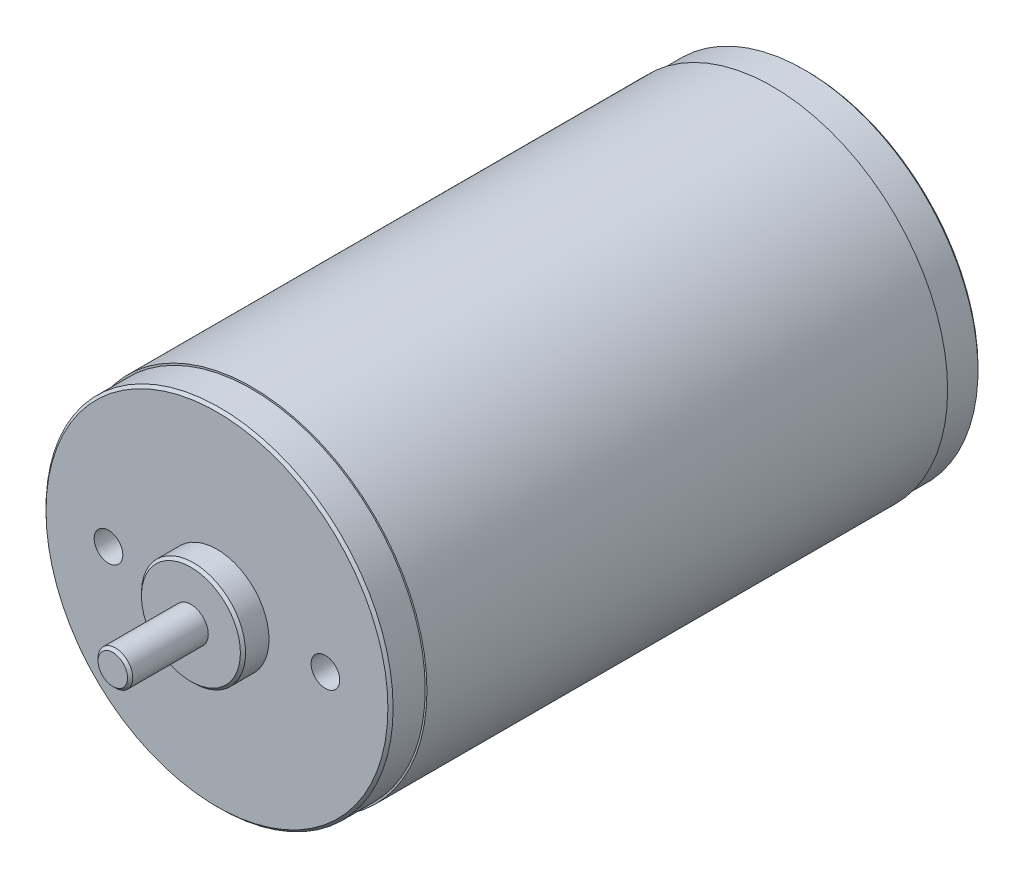
ISO-10303-21;
HEADER;
FILE_DESCRIPTION(('STEP AP214'),'2;1');
FILE_NAME('part.step','',(''),(''),'','','');
FILE_SCHEMA(('AUTOMOTIVE_DESIGN { 1 0 10303 214 1 1 1 1 }'));
ENDSEC;
DATA;
#1=APPLICATION_CONTEXT('core data for automotive mechanical design processes');
#2=APPLICATION_PROTOCOL_DEFINITION('international standard','automotive_design',2000,#1);
#3=PRODUCT_CONTEXT('',#1,'mechanical');
#4=PRODUCT('Part','Part','',(#3));
#5=PRODUCT_RELATED_PRODUCT_CATEGORY('part','',(#4));
#6=PRODUCT_DEFINITION_FORMATION('','',#4);
#7=PRODUCT_DEFINITION_CONTEXT('part definition',#1,'design');
#8=PRODUCT_DEFINITION('design','',#6,#7);
#9=PRODUCT_DEFINITION_SHAPE('','',#8);
#10=(LENGTH_UNIT() NAMED_UNIT(*) SI_UNIT(.MILLI.,.METRE.));
#11=(NAMED_UNIT(*) PLANE_ANGLE_UNIT() SI_UNIT($,.RADIAN.));
#12=(NAMED_UNIT(*) SI_UNIT($,.STERADIAN.) SOLID_ANGLE_UNIT());
#13=UNCERTAINTY_MEASURE_WITH_UNIT(LENGTH_MEASURE(1.E-05),#10,'distance_accuracy_value','');
#14=(GEOMETRIC_REPRESENTATION_CONTEXT(3) GLOBAL_UNCERTAINTY_ASSIGNED_CONTEXT((#13)) GLOBAL_UNIT_ASSIGNED_CONTEXT((#10,
#11,#12)) REPRESENTATION_CONTEXT('',''));
#15=CARTESIAN_POINT('',(0.,0.,0.));
#16=DIRECTION('',(0.,0.,1.));
#17=DIRECTION('',(1.,0.,0.));
#18=AXIS2_PLACEMENT_3D('',#15,#16,#17);
#19=CARTESIAN_POINT('',(0.,0.,-68.));
#20=DIRECTION('',(0.,0.,-1.));
#21=DIRECTION('',(-1.,0.,0.));
#22=AXIS2_PLACEMENT_3D('',#19,#20,#21);
#23=PLANE('',#22);
#24=CARTESIAN_POINT('',(0.,0.,-68.));
#25=DIRECTION('',(0.,0.,-1.));
#26=DIRECTION('',(-1.,0.,0.));
#27=AXIS2_PLACEMENT_3D('',#24,#25,#26);
#28=CIRCLE('',#27,19.7000000000306);
#29=CARTESIAN_POINT('',(-19.7000000000306,0.,-68.));
#30=VERTEX_POINT('',#29);
#31=EDGE_CURVE('E90',#30,#30,#28,.T.);
#32=ORIENTED_EDGE('',*,*,#31,.T.);
#33=EDGE_LOOP('',(#32));
#34=FACE_BOUND('',#33,.T.);
#35=CARTESIAN_POINT('',(0.,0.,-68.));
#36=DIRECTION('',(0.,0.,-1.));
#37=DIRECTION('',(-1.,0.,0.));
#38=AXIS2_PLACEMENT_3D('',#35,#36,#37);
#39=CIRCLE('',#38,6.325);
#40=CARTESIAN_POINT('',(-6.325,0.,-68.));
#41=VERTEX_POINT('',#40);
#42=EDGE_CURVE('E69',#41,#41,#39,.T.);
#43=ORIENTED_EDGE('',*,*,#42,.F.);
#44=EDGE_LOOP('',(#43));
#45=FACE_BOUND('',#44,.T.);
#46=ADVANCED_FACE('F34',(#34,#45),#23,.T.);
#47=CARTESIAN_POINT('',(20.2,0.,-64.));
#48=DIRECTION('',(0.,0.,-1.));
#49=DIRECTION('',(-1.,0.,0.));
#50=AXIS2_PLACEMENT_3D('',#47,#48,#49);
#51=PLANE('',#50);
#52=CARTESIAN_POINT('',(0.,0.,-64.));
#53=DIRECTION('',(0.,0.,1.));
#54=DIRECTION('',(1.,0.,0.));
#55=AXIS2_PLACEMENT_3D('',#52,#53,#54);
#56=CIRCLE('',#55,20.2);
#57=CARTESIAN_POINT('',(20.2,0.,-64.));
#58=VERTEX_POINT('',#57);
#59=EDGE_CURVE('E87',#58,#58,#56,.T.);
#60=ORIENTED_EDGE('',*,*,#59,.F.);
#61=EDGE_LOOP('',(#60));
#62=FACE_BOUND('',#61,.T.);
#63=CARTESIAN_POINT('',(0.,0.,-64.));
#64=DIRECTION('',(0.,0.,-1.));
#65=DIRECTION('',(-1.,0.,0.));
#66=AXIS2_PLACEMENT_3D('',#63,#64,#65);
#67=CIRCLE('',#66,20.);
#68=CARTESIAN_POINT('',(-20.,0.,-64.));
#69=VERTEX_POINT('',#68);
#70=EDGE_CURVE('E72',#69,#69,#67,.T.);
#71=ORIENTED_EDGE('',*,*,#70,.F.);
#72=EDGE_LOOP('',(#71));
#73=FACE_BOUND('',#72,.T.);
#74=ADVANCED_FACE('F129',(#62,#73),#51,.T.);
#75=CARTESIAN_POINT('',(0.,0.,3.));
#76=DIRECTION('',(0.,0.,1.));
#77=DIRECTION('',(1.,0.,0.));
#78=AXIS2_PLACEMENT_3D('',#75,#76,#77);
#79=PLANE('',#78);
#80=CARTESIAN_POINT('',(0.,0.,3.));
#81=DIRECTION('',(0.,0.,1.));
#82=DIRECTION('',(1.,0.,0.));
#83=AXIS2_PLACEMENT_3D('',#80,#81,#82);
#84=CIRCLE('',#83,5.70000000003062);
#85=CARTESIAN_POINT('',(5.70000000003062,0.,3.));
#86=VERTEX_POINT('',#85);
#87=EDGE_CURVE('E42',#86,#86,#84,.T.);
#88=ORIENTED_EDGE('',*,*,#87,.T.);
#89=EDGE_LOOP('',(#88));
#90=FACE_BOUND('',#89,.T.);
#91=CARTESIAN_POINT('',(0.,0.,3.));
#92=DIRECTION('',(0.,0.,1.));
#93=DIRECTION('',(1.,0.,0.));
#94=AXIS2_PLACEMENT_3D('',#91,#92,#93);
#95=CIRCLE('',#94,2.);
#96=CARTESIAN_POINT('',(2.,0.,3.));
#97=VERTEX_POINT('',#96);
#98=EDGE_CURVE('E75',#97,#97,#95,.T.);
#99=ORIENTED_EDGE('',*,*,#98,.F.);
#100=EDGE_LOOP('',(#99));
#101=FACE_BOUND('',#100,.T.);
#102=ADVANCED_FACE('F116',(#90,#101),#79,.T.);
#103=CARTESIAN_POINT('',(0.,0.,0.));
#104=DIRECTION('',(0.,0.,1.));
#105=DIRECTION('',(1.,0.,0.));
#106=AXIS2_PLACEMENT_3D('',#103,#104,#105);
#107=PLANE('',#106);
#108=CARTESIAN_POINT('',(0.,0.,0.));
#109=DIRECTION('',(0.,0.,1.));
#110=DIRECTION('',(1.,0.,0.));
#111=AXIS2_PLACEMENT_3D('',#108,#109,#110);
#112=CIRCLE('',#111,19.7000000000306);
#113=CARTESIAN_POINT('',(19.7000000000306,0.,0.));
#114=VERTEX_POINT('',#113);
#115=EDGE_CURVE('E102',#114,#114,#112,.T.);
#116=ORIENTED_EDGE('',*,*,#115,.T.);
#117=EDGE_LOOP('',(#116));
#118=FACE_BOUND('',#117,.T.);
#119=CARTESIAN_POINT('',(-12.5,0.,0.));
#120=DIRECTION('',(0.,0.,1.));
#121=DIRECTION('',(1.,0.,0.));
#122=AXIS2_PLACEMENT_3D('',#119,#120,#121);
#123=CIRCLE('',#122,1.64999999999999);
#124=CARTESIAN_POINT('',(-10.85,0.,0.));
#125=VERTEX_POINT('',#124);
#126=EDGE_CURVE('E59',#125,#125,#123,.T.);
#127=ORIENTED_EDGE('',*,*,#126,.F.);
#128=EDGE_LOOP('',(#127));
#129=FACE_BOUND('',#128,.T.);
#130=CARTESIAN_POINT('',(12.5,0.,0.));
#131=DIRECTION('',(0.,0.,1.));
#132=DIRECTION('',(1.,0.,0.));
#133=AXIS2_PLACEMENT_3D('',#130,#131,#132);
#134=CIRCLE('',#133,1.64999999999999);
#135=CARTESIAN_POINT('',(14.15,0.,0.));
#136=VERTEX_POINT('',#135);
#137=EDGE_CURVE('E58',#136,#136,#134,.T.);
#138=ORIENTED_EDGE('',*,*,#137,.F.);
#139=EDGE_LOOP('',(#138));
#140=FACE_BOUND('',#139,.T.);
#141=CARTESIAN_POINT('',(0.,0.,0.));
#142=DIRECTION('',(0.,0.,1.));
#143=DIRECTION('',(1.,0.,0.));
#144=AXIS2_PLACEMENT_3D('',#141,#142,#143);
#145=CIRCLE('',#144,6.);
#146=CARTESIAN_POINT('',(6.,0.,0.));
#147=VERTEX_POINT('',#146);
#148=EDGE_CURVE('E78',#147,#147,#145,.T.);
#149=ORIENTED_EDGE('',*,*,#148,.F.);
#150=EDGE_LOOP('',(#149));
#151=FACE_BOUND('',#150,.T.);
#152=ADVANCED_FACE('F157',(#118,#129,#140,#151),#107,.T.);
#153=CARTESIAN_POINT('',(0.,0.,-4.));
#154=DIRECTION('',(0.,0.,1.));
#155=DIRECTION('',(1.,0.,0.));
#156=AXIS2_PLACEMENT_3D('',#153,#154,#155);
#157=PLANE('',#156);
#158=CARTESIAN_POINT('',(0.,0.,-4.));
#159=DIRECTION('',(0.,0.,1.));
#160=DIRECTION('',(1.,0.,0.));
#161=AXIS2_PLACEMENT_3D('',#158,#159,#160);
#162=CIRCLE('',#161,20.2);
#163=CARTESIAN_POINT('',(20.2,0.,-4.));
#164=VERTEX_POINT('',#163);
#165=EDGE_CURVE('E84',#164,#164,#162,.T.);
#166=ORIENTED_EDGE('',*,*,#165,.T.);
#167=EDGE_LOOP('',(#166));
#168=FACE_BOUND('',#167,.T.);
#169=CARTESIAN_POINT('',(0.,0.,-4.));
#170=DIRECTION('',(0.,0.,1.));
#171=DIRECTION('',(1.,0.,0.));
#172=AXIS2_PLACEMENT_3D('',#169,#170,#171);
#173=CIRCLE('',#172,20.);
#174=CARTESIAN_POINT('',(20.,0.,-4.));
#175=VERTEX_POINT('',#174);
#176=EDGE_CURVE('E81',#175,#175,#173,.T.);
#177=ORIENTED_EDGE('',*,*,#176,.F.);
#178=EDGE_LOOP('',(#177));
#179=FACE_BOUND('',#178,.T.);
#180=ADVANCED_FACE('F164',(#168,#179),#157,.T.);
#181=CARTESIAN_POINT('',(0.,0.,-64.));
#182=DIRECTION('',(0.,0.,1.));
#183=DIRECTION('',(1.,0.,0.));
#184=AXIS2_PLACEMENT_3D('',#181,#182,#183);
#185=CYLINDRICAL_SURFACE('',#184,20.2);
#186=ORIENTED_EDGE('',*,*,#59,.T.);
#187=EDGE_LOOP('',(#186));
#188=FACE_BOUND('',#187,.T.);
#189=ORIENTED_EDGE('',*,*,#165,.F.);
#190=EDGE_LOOP('',(#189));
#191=FACE_BOUND('',#190,.T.);
#192=ADVANCED_FACE('F168',(#188,#191),#185,.T.);
#193=CARTESIAN_POINT('',(0.,0.,0.));
#194=DIRECTION('',(0.,0.,-1.));
#195=DIRECTION('',(-1.,0.,0.));
#196=AXIS2_PLACEMENT_3D('',#193,#194,#195);
#197=CYLINDRICAL_SURFACE('',#196,20.);
#198=CARTESIAN_POINT('',(0.,0.,-0.299999999969389));
#199=DIRECTION('',(0.,0.,1.));
#200=DIRECTION('',(1.,0.,0.));
#201=AXIS2_PLACEMENT_3D('',#198,#199,#200);
#202=CIRCLE('',#201,20.);
#203=CARTESIAN_POINT('',(20.,0.,-0.299999999969389));
#204=VERTEX_POINT('',#203);
#205=EDGE_CURVE('E105',#204,#204,#202,.F.);
#206=ORIENTED_EDGE('',*,*,#205,.T.);
#207=EDGE_LOOP('',(#206));
#208=FACE_BOUND('',#207,.T.);
#209=ORIENTED_EDGE('',*,*,#176,.T.);
#210=EDGE_LOOP('',(#209));
#211=FACE_BOUND('',#210,.T.);
#212=ADVANCED_FACE('F160',(#208,#211),#197,.T.);
#213=CARTESIAN_POINT('',(0.,0.,3.));
#214=DIRECTION('',(0.,0.,-1.));
#215=DIRECTION('',(-1.,0.,0.));
#216=AXIS2_PLACEMENT_3D('',#213,#214,#215);
#217=CYLINDRICAL_SURFACE('',#216,6.);
#218=CARTESIAN_POINT('',(0.,0.,2.70000000003062));
#219=DIRECTION('',(0.,0.,1.));
#220=DIRECTION('',(1.,0.,0.));
#221=AXIS2_PLACEMENT_3D('',#218,#219,#220);
#222=CIRCLE('',#221,6.);
#223=CARTESIAN_POINT('',(6.,0.,2.70000000003062));
#224=VERTEX_POINT('',#223);
#225=EDGE_CURVE('E11',#224,#224,#222,.F.);
#226=ORIENTED_EDGE('',*,*,#225,.T.);
#227=EDGE_LOOP('',(#226));
#228=FACE_BOUND('',#227,.T.);
#229=ORIENTED_EDGE('',*,*,#148,.T.);
#230=EDGE_LOOP('',(#229));
#231=FACE_BOUND('',#230,.T.);
#232=ADVANCED_FACE('F153',(#228,#231),#217,.T.);
#233=CARTESIAN_POINT('',(0.,0.,12.));
#234=DIRECTION('',(0.,0.,-1.));
#235=DIRECTION('',(-1.,0.,0.));
#236=AXIS2_PLACEMENT_3D('',#233,#234,#235);
#237=CYLINDRICAL_SURFACE('',#236,2.);
#238=CARTESIAN_POINT('',(0.,0.,11.7000000000306));
#239=DIRECTION('',(0.,0.,1.));
#240=DIRECTION('',(1.,0.,0.));
#241=AXIS2_PLACEMENT_3D('',#238,#239,#240);
#242=CIRCLE('',#241,2.);
#243=CARTESIAN_POINT('',(2.,0.,11.7000000000306));
#244=VERTEX_POINT('',#243);
#245=EDGE_CURVE('E99',#244,#244,#242,.F.);
#246=ORIENTED_EDGE('',*,*,#245,.T.);
#247=EDGE_LOOP('',(#246));
#248=FACE_BOUND('',#247,.T.);
#249=ORIENTED_EDGE('',*,*,#98,.T.);
#250=EDGE_LOOP('',(#249));
#251=FACE_BOUND('',#250,.T.);
#252=ADVANCED_FACE('F149',(#248,#251),#237,.T.);
#253=CARTESIAN_POINT('',(0.,0.,12.));
#254=DIRECTION('',(0.,0.,1.));
#255=DIRECTION('',(1.,0.,0.));
#256=AXIS2_PLACEMENT_3D('',#253,#254,#255);
#257=PLANE('',#256);
#258=CARTESIAN_POINT('',(0.,0.,12.));
#259=DIRECTION('',(0.,0.,1.));
#260=DIRECTION('',(1.,0.,0.));
#261=AXIS2_PLACEMENT_3D('',#258,#259,#260);
#262=CIRCLE('',#261,1.70000000003065);
#263=CARTESIAN_POINT('',(1.70000000003065,0.,12.));
#264=VERTEX_POINT('',#263);
#265=EDGE_CURVE('E96',#264,#264,#262,.T.);
#266=ORIENTED_EDGE('',*,*,#265,.T.);
#267=EDGE_LOOP('',(#266));
#268=FACE_BOUND('',#267,.T.);
#269=ADVANCED_FACE('F145',(#268),#257,.T.);
#270=CARTESIAN_POINT('',(0.,0.,-68.));
#271=DIRECTION('',(0.,0.,1.));
#272=DIRECTION('',(1.,0.,0.));
#273=AXIS2_PLACEMENT_3D('',#270,#271,#272);
#274=CYLINDRICAL_SURFACE('',#273,20.);
#275=CARTESIAN_POINT('',(0.,0.,-67.7000000000306));
#276=DIRECTION('',(0.,0.,-1.));
#277=DIRECTION('',(-1.,0.,0.));
#278=AXIS2_PLACEMENT_3D('',#275,#276,#277);
#279=CIRCLE('',#278,20.);
#280=CARTESIAN_POINT('',(-20.,0.,-67.7000000000306));
#281=VERTEX_POINT('',#280);
#282=EDGE_CURVE('E93',#281,#281,#279,.F.);
#283=ORIENTED_EDGE('',*,*,#282,.T.);
#284=EDGE_LOOP('',(#283));
#285=FACE_BOUND('',#284,.T.);
#286=ORIENTED_EDGE('',*,*,#70,.T.);
#287=EDGE_LOOP('',(#286));
#288=FACE_BOUND('',#287,.T.);
#289=ADVANCED_FACE('F142',(#285,#288),#274,.T.);
#290=CARTESIAN_POINT('',(0.,0.,-69.5));
#291=DIRECTION('',(0.,0.,1.));
#292=DIRECTION('',(1.,0.,0.));
#293=AXIS2_PLACEMENT_3D('',#290,#291,#292);
#294=CYLINDRICAL_SURFACE('',#293,6.325);
#295=CARTESIAN_POINT('',(0.,0.,-69.2000000000306));
#296=DIRECTION('',(0.,0.,-1.));
#297=DIRECTION('',(-1.,0.,0.));
#298=AXIS2_PLACEMENT_3D('',#295,#296,#297);
#299=CIRCLE('',#298,6.325);
#300=CARTESIAN_POINT('',(-6.325,0.,-69.2000000000306));
#301=VERTEX_POINT('',#300);
#302=EDGE_CURVE('E111',#301,#301,#299,.F.);
#303=ORIENTED_EDGE('',*,*,#302,.T.);
#304=EDGE_LOOP('',(#303));
#305=FACE_BOUND('',#304,.T.);
#306=ORIENTED_EDGE('',*,*,#42,.T.);
#307=EDGE_LOOP('',(#306));
#308=FACE_BOUND('',#307,.T.);
#309=ADVANCED_FACE('F140',(#305,#308),#294,.T.);
#310=CARTESIAN_POINT('',(0.,0.,-69.5));
#311=DIRECTION('',(0.,0.,-1.));
#312=DIRECTION('',(-1.,0.,0.));
#313=AXIS2_PLACEMENT_3D('',#310,#311,#312);
#314=PLANE('',#313);
#315=CARTESIAN_POINT('',(0.,0.,-69.5));
#316=DIRECTION('',(0.,0.,-1.));
#317=DIRECTION('',(-1.,0.,0.));
#318=AXIS2_PLACEMENT_3D('',#315,#316,#317);
#319=CIRCLE('',#318,6.02500000003062);
#320=CARTESIAN_POINT('',(-6.02500000003062,0.,-69.5));
#321=VERTEX_POINT('',#320);
#322=EDGE_CURVE('E108',#321,#321,#319,.T.);
#323=ORIENTED_EDGE('',*,*,#322,.T.);
#324=EDGE_LOOP('',(#323));
#325=FACE_BOUND('',#324,.T.);
#326=ADVANCED_FACE('F206',(#325),#314,.T.);
#327=CARTESIAN_POINT('',(12.5,0.,-8.1));
#328=DIRECTION('',(0.,0.,1.));
#329=DIRECTION('',(1.,0.,0.));
#330=AXIS2_PLACEMENT_3D('',#327,#328,#329);
#331=CONICAL_SURFACE('',#330,1.64999999999999,1.02974425849464);
#332=CARTESIAN_POINT('',(12.5,0.,-9.09142002180421));
#333=VERTEX_POINT('',#332);
#334=VERTEX_LOOP('',#333);
#335=FACE_BOUND('',#334,.T.);
#336=CARTESIAN_POINT('',(12.5,0.,-8.1));
#337=DIRECTION('',(0.,0.,1.));
#338=DIRECTION('',(1.,0.,0.));
#339=AXIS2_PLACEMENT_3D('',#336,#337,#338);
#340=CIRCLE('',#339,1.64999999999999);
#341=CARTESIAN_POINT('',(14.15,0.,-8.1));
#342=VERTEX_POINT('',#341);
#343=EDGE_CURVE('E62',#342,#342,#340,.T.);
#344=ORIENTED_EDGE('',*,*,#343,.T.);
#345=EDGE_LOOP('',(#344));
#346=FACE_BOUND('',#345,.T.);
#347=ADVANCED_FACE('F200',(#335,#346),#331,.F.);
#348=CARTESIAN_POINT('',(12.5,0.,0.));
#349=DIRECTION('',(0.,0.,1.));
#350=DIRECTION('',(1.,0.,0.));
#351=AXIS2_PLACEMENT_3D('',#348,#349,#350);
#352=CYLINDRICAL_SURFACE('',#351,1.64999999999999);
#353=ORIENTED_EDGE('',*,*,#343,.F.);
#354=EDGE_LOOP('',(#353));
#355=FACE_BOUND('',#354,.T.);
#356=ORIENTED_EDGE('',*,*,#137,.T.);
#357=EDGE_LOOP('',(#356));
#358=FACE_BOUND('',#357,.T.);
#359=ADVANCED_FACE('F52',(#355,#358),#352,.F.);
#360=CARTESIAN_POINT('',(-12.5,0.,-8.1));
#361=DIRECTION('',(0.,0.,1.));
#362=DIRECTION('',(1.,0.,0.));
#363=AXIS2_PLACEMENT_3D('',#360,#361,#362);
#364=CONICAL_SURFACE('',#363,1.64999999999999,1.02974425849464);
#365=CARTESIAN_POINT('',(-12.5,0.,-9.09142002180421));
#366=VERTEX_POINT('',#365);
#367=VERTEX_LOOP('',#366);
#368=FACE_BOUND('',#367,.T.);
#369=CARTESIAN_POINT('',(-12.5,0.,-8.1));
#370=DIRECTION('',(0.,0.,1.));
#371=DIRECTION('',(1.,0.,0.));
#372=AXIS2_PLACEMENT_3D('',#369,#370,#371);
#373=CIRCLE('',#372,1.64999999999999);
#374=CARTESIAN_POINT('',(-10.85,0.,-8.1));
#375=VERTEX_POINT('',#374);
#376=EDGE_CURVE('E56',#375,#375,#373,.T.);
#377=ORIENTED_EDGE('',*,*,#376,.T.);
#378=EDGE_LOOP('',(#377));
#379=FACE_BOUND('',#378,.T.);
#380=ADVANCED_FACE('F48',(#368,#379),#364,.F.);
#381=CARTESIAN_POINT('',(-12.5,0.,0.));
#382=DIRECTION('',(0.,0.,1.));
#383=DIRECTION('',(1.,0.,0.));
#384=AXIS2_PLACEMENT_3D('',#381,#382,#383);
#385=CYLINDRICAL_SURFACE('',#384,1.64999999999999);
#386=ORIENTED_EDGE('',*,*,#376,.F.);
#387=EDGE_LOOP('',(#386));
#388=FACE_BOUND('',#387,.T.);
#389=ORIENTED_EDGE('',*,*,#126,.T.);
#390=EDGE_LOOP('',(#389));
#391=FACE_BOUND('',#390,.T.);
#392=ADVANCED_FACE('F51',(#388,#391),#385,.F.);
#393=CARTESIAN_POINT('',(0.,0.,-68.));
#394=DIRECTION('',(0.,0.,1.));
#395=DIRECTION('',(1.,0.,0.));
#396=AXIS2_PLACEMENT_3D('',#393,#394,#395);
#397=CONICAL_SURFACE('',#396,19.7000000000306,0.785398163397466);
#398=ORIENTED_EDGE('',*,*,#282,.F.);
#399=EDGE_LOOP('',(#398));
#400=FACE_BOUND('',#399,.T.);
#401=ORIENTED_EDGE('',*,*,#31,.F.);
#402=EDGE_LOOP('',(#401));
#403=FACE_BOUND('',#402,.T.);
#404=ADVANCED_FACE('F176',(#400,#403),#397,.T.);
#405=CARTESIAN_POINT('',(0.,0.,12.));
#406=DIRECTION('',(0.,0.,-1.));
#407=DIRECTION('',(-1.,0.,0.));
#408=AXIS2_PLACEMENT_3D('',#405,#406,#407);
#409=CONICAL_SURFACE('',#408,1.70000000003065,0.785398163397431);
#410=ORIENTED_EDGE('',*,*,#245,.F.);
#411=EDGE_LOOP('',(#410));
#412=FACE_BOUND('',#411,.T.);
#413=ORIENTED_EDGE('',*,*,#265,.F.);
#414=EDGE_LOOP('',(#413));
#415=FACE_BOUND('',#414,.T.);
#416=ADVANCED_FACE('F179',(#412,#415),#409,.T.);
#417=CARTESIAN_POINT('',(0.,0.,0.));
#418=DIRECTION('',(0.,0.,-1.));
#419=DIRECTION('',(-1.,0.,0.));
#420=AXIS2_PLACEMENT_3D('',#417,#418,#419);
#421=CONICAL_SURFACE('',#420,19.7000000000306,0.785398163397454);
#422=ORIENTED_EDGE('',*,*,#205,.F.);
#423=EDGE_LOOP('',(#422));
#424=FACE_BOUND('',#423,.T.);
#425=ORIENTED_EDGE('',*,*,#115,.F.);
#426=EDGE_LOOP('',(#425));
#427=FACE_BOUND('',#426,.T.);
#428=ADVANCED_FACE('F125',(#424,#427),#421,.T.);
#429=CARTESIAN_POINT('',(0.,0.,-69.5));
#430=DIRECTION('',(0.,0.,1.));
#431=DIRECTION('',(1.,0.,0.));
#432=AXIS2_PLACEMENT_3D('',#429,#430,#431);
#433=CONICAL_SURFACE('',#432,6.02500000003062,0.785398163397431);
#434=ORIENTED_EDGE('',*,*,#302,.F.);
#435=EDGE_LOOP('',(#434));
#436=FACE_BOUND('',#435,.T.);
#437=ORIENTED_EDGE('',*,*,#322,.F.);
#438=EDGE_LOOP('',(#437));
#439=FACE_BOUND('',#438,.T.);
#440=ADVANCED_FACE('F120',(#436,#439),#433,.T.);
#441=CARTESIAN_POINT('',(0.,0.,3.));
#442=DIRECTION('',(0.,0.,-1.));
#443=DIRECTION('',(-1.,0.,0.));
#444=AXIS2_PLACEMENT_3D('',#441,#442,#443);
#445=CONICAL_SURFACE('',#444,5.70000000003062,0.785398163397438);
#446=ORIENTED_EDGE('',*,*,#225,.F.);
#447=EDGE_LOOP('',(#446));
#448=FACE_BOUND('',#447,.T.);
#449=ORIENTED_EDGE('',*,*,#87,.F.);
#450=EDGE_LOOP('',(#449));
#451=FACE_BOUND('',#450,.T.);
#452=ADVANCED_FACE('F36',(#448,#451),#445,.T.);
#453=CLOSED_SHELL('',(#46,#74,#102,#152,#180,#192,#212,#232,#252,#269,#289,#309,#326,#347,#359,
#380,#392,#404,#416,#428,#440,#452));
#454=MANIFOLD_SOLID_BREP('B2',#453);
#455=ADVANCED_BREP_SHAPE_REPRESENTATION('',(#18,#454),#14);
#456=SHAPE_DEFINITION_REPRESENTATION(#9,#455);
ENDSEC;
END-ISO-10303-21;
